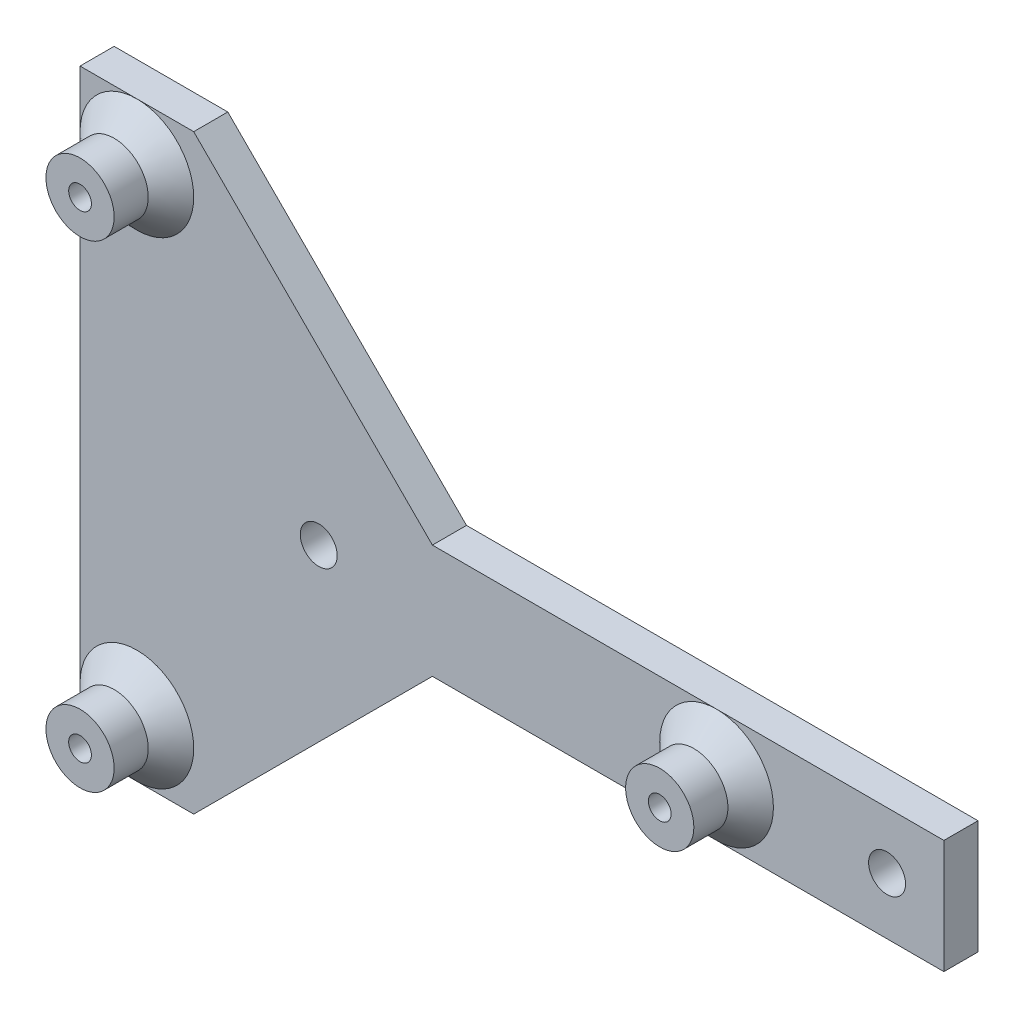
ISO-10303-21;
HEADER;
FILE_DESCRIPTION(('STEP AP214'),'2;1');
FILE_NAME('part.step','',(''),(''),'','','');
FILE_SCHEMA(('AUTOMOTIVE_DESIGN { 1 0 10303 214 1 1 1 1 }'));
ENDSEC;
DATA;
#1=APPLICATION_CONTEXT('core data for automotive mechanical design processes');
#2=APPLICATION_PROTOCOL_DEFINITION('international standard','automotive_design',2000,#1);
#3=PRODUCT_CONTEXT('',#1,'mechanical');
#4=PRODUCT('Part','Part','',(#3));
#5=PRODUCT_RELATED_PRODUCT_CATEGORY('part','',(#4));
#6=PRODUCT_DEFINITION_FORMATION('','',#4);
#7=PRODUCT_DEFINITION_CONTEXT('part definition',#1,'design');
#8=PRODUCT_DEFINITION('design','',#6,#7);
#9=PRODUCT_DEFINITION_SHAPE('','',#8);
#10=(LENGTH_UNIT() NAMED_UNIT(*) SI_UNIT(.MILLI.,.METRE.));
#11=(NAMED_UNIT(*) PLANE_ANGLE_UNIT() SI_UNIT($,.RADIAN.));
#12=(NAMED_UNIT(*) SI_UNIT($,.STERADIAN.) SOLID_ANGLE_UNIT());
#13=UNCERTAINTY_MEASURE_WITH_UNIT(LENGTH_MEASURE(1.E-05),#10,'distance_accuracy_value','');
#14=(GEOMETRIC_REPRESENTATION_CONTEXT(3) GLOBAL_UNCERTAINTY_ASSIGNED_CONTEXT((#13)) GLOBAL_UNIT_ASSIGNED_CONTEXT((#10,
#11,#12)) REPRESENTATION_CONTEXT('',''));
#15=CARTESIAN_POINT('',(0.,0.,0.));
#16=DIRECTION('',(0.,0.,1.));
#17=DIRECTION('',(1.,0.,0.));
#18=AXIS2_PLACEMENT_3D('',#15,#16,#17);
#19=CARTESIAN_POINT('',(0.,0.,3.));
#20=DIRECTION('',(0.,0.,1.));
#21=DIRECTION('',(1.,0.,0.));
#22=AXIS2_PLACEMENT_3D('',#19,#20,#21);
#23=PLANE('',#22);
#24=CARTESIAN_POINT('',(0.,0.,3.));
#25=DIRECTION('',(0.,0.,1.));
#26=DIRECTION('',(1.,0.,0.));
#27=AXIS2_PLACEMENT_3D('',#24,#25,#26);
#28=CIRCLE('',#27,1.625);
#29=CARTESIAN_POINT('',(1.625,0.,3.));
#30=VERTEX_POINT('',#29);
#31=EDGE_CURVE('E230',#30,#30,#28,.T.);
#32=ORIENTED_EDGE('',*,*,#31,.F.);
#33=EDGE_LOOP('',(#32));
#34=FACE_BOUND('',#33,.T.);
#35=DIRECTION('',(-1.,0.,0.));
#36=VECTOR('',#35,1.);
#37=CARTESIAN_POINT('',(-5.,5.,3.));
#38=LINE('',#37,#36);
#39=CARTESIAN_POINT('',(5.,5.,3.));
#40=VERTEX_POINT('',#39);
#41=CARTESIAN_POINT('',(-15.,5.,3.));
#42=VERTEX_POINT('',#41);
#43=EDGE_CURVE('E234',#40,#42,#38,.T.);
#44=ORIENTED_EDGE('',*,*,#43,.T.);
#45=CARTESIAN_POINT('',(-15.,0.,3.));
#46=DIRECTION('',(0.,0.,1.));
#47=DIRECTION('',(1.,0.,0.));
#48=AXIS2_PLACEMENT_3D('',#45,#46,#47);
#49=CIRCLE('',#48,5.00000000000002);
#50=CARTESIAN_POINT('',(-15.,-5.,3.));
#51=VERTEX_POINT('',#50);
#52=EDGE_CURVE('E183',#42,#51,#49,.F.);
#53=ORIENTED_EDGE('',*,*,#52,.T.);
#54=DIRECTION('',(1.,0.,0.));
#55=VECTOR('',#54,1.);
#56=CARTESIAN_POINT('',(-5.,-5.,3.));
#57=LINE('',#56,#55);
#58=CARTESIAN_POINT('',(5.,-5.,3.));
#59=VERTEX_POINT('',#58);
#60=EDGE_CURVE('E233',#51,#59,#57,.T.);
#61=ORIENTED_EDGE('',*,*,#60,.T.);
#62=DIRECTION('',(0.,1.,0.));
#63=VECTOR('',#62,1.);
#64=CARTESIAN_POINT('',(5.,5.,3.));
#65=LINE('',#64,#63);
#66=EDGE_CURVE('E222',#59,#40,#65,.T.);
#67=ORIENTED_EDGE('',*,*,#66,.T.);
#68=EDGE_LOOP('',(#44,#53,#61,#67));
#69=FACE_BOUND('',#68,.T.);
#70=ADVANCED_FACE('F41',(#34,#69),#23,.T.);
#71=DIRECTION('',(0.,-1.,0.));
#72=VECTOR('',#71,1.);
#73=CARTESIAN_POINT('',(-71.,26.,3.));
#74=LINE('',#73,#72);
#75=CARTESIAN_POINT('',(-71.,26.,3.));
#76=VERTEX_POINT('',#75);
#77=CARTESIAN_POINT('',(-71.,21.,3.));
#78=VERTEX_POINT('',#77);
#79=EDGE_CURVE('E275',#76,#78,#74,.T.);
#80=ORIENTED_EDGE('',*,*,#79,.T.);
#81=CARTESIAN_POINT('',(-66.,21.,3.));
#82=DIRECTION('',(0.,0.,1.));
#83=DIRECTION('',(1.,0.,0.));
#84=AXIS2_PLACEMENT_3D('',#81,#82,#83);
#85=CIRCLE('',#84,5.00000000000003);
#86=CARTESIAN_POINT('',(-66.,26.,3.));
#87=VERTEX_POINT('',#86);
#88=EDGE_CURVE('E191',#78,#87,#85,.F.);
#89=ORIENTED_EDGE('',*,*,#88,.T.);
#90=DIRECTION('',(-1.,0.,0.));
#91=VECTOR('',#90,1.);
#92=CARTESIAN_POINT('',(-71.,26.,3.));
#93=LINE('',#92,#91);
#94=EDGE_CURVE('E283',#87,#76,#93,.T.);
#95=ORIENTED_EDGE('',*,*,#94,.T.);
#96=EDGE_LOOP('',(#80,#89,#95));
#97=FACE_BOUND('',#96,.T.);
#98=ADVANCED_FACE('F341',(#97),#23,.T.);
#99=DIRECTION('',(1.,0.,0.));
#100=VECTOR('',#99,1.);
#101=CARTESIAN_POINT('',(-71.,-26.,3.));
#102=LINE('',#101,#100);
#103=CARTESIAN_POINT('',(-66.,-26.,3.));
#104=VERTEX_POINT('',#103);
#105=CARTESIAN_POINT('',(-61.,-26.,3.));
#106=VERTEX_POINT('',#105);
#107=EDGE_CURVE('E274',#104,#106,#102,.T.);
#108=ORIENTED_EDGE('',*,*,#107,.T.);
#109=DIRECTION('',(0.707106781186544,0.707106781186551,0.));
#110=VECTOR('',#109,1.);
#111=CARTESIAN_POINT('',(-61.,-26.0000000000002,3.));
#112=LINE('',#111,#110);
#113=CARTESIAN_POINT('',(-40.0000000000001,-5.,3.));
#114=VERTEX_POINT('',#113);
#115=EDGE_CURVE('E51',#106,#114,#112,.T.);
#116=ORIENTED_EDGE('',*,*,#115,.T.);
#117=EDGE_CURVE('E58',#114,#51,#57,.T.);
#118=ORIENTED_EDGE('',*,*,#117,.T.);
#119=CARTESIAN_POINT('',(-15.,0.,3.));
#120=DIRECTION('',(0.,0.,1.));
#121=DIRECTION('',(1.,0.,0.));
#122=AXIS2_PLACEMENT_3D('',#119,#120,#121);
#123=CIRCLE('',#122,5.00000000000002);
#124=EDGE_CURVE('E179',#51,#42,#123,.F.);
#125=ORIENTED_EDGE('',*,*,#124,.T.);
#126=CARTESIAN_POINT('',(-39.9999999999999,5.,3.));
#127=VERTEX_POINT('',#126);
#128=EDGE_CURVE('E238',#42,#127,#38,.T.);
#129=ORIENTED_EDGE('',*,*,#128,.T.);
#130=DIRECTION('',(-0.707106781186549,0.707106781186546,0.));
#131=VECTOR('',#130,1.);
#132=CARTESIAN_POINT('',(-39.9999999999999,5.,3.));
#133=LINE('',#132,#131);
#134=CARTESIAN_POINT('',(-61.,26.,3.));
#135=VERTEX_POINT('',#134);
#136=EDGE_CURVE('E160',#127,#135,#133,.T.);
#137=ORIENTED_EDGE('',*,*,#136,.T.);
#138=EDGE_CURVE('E66',#135,#87,#93,.T.);
#139=ORIENTED_EDGE('',*,*,#138,.T.);
#140=CARTESIAN_POINT('',(-66.,21.,3.));
#141=DIRECTION('',(0.,0.,1.));
#142=DIRECTION('',(1.,0.,0.));
#143=AXIS2_PLACEMENT_3D('',#140,#141,#142);
#144=CIRCLE('',#143,5.00000000000003);
#145=CARTESIAN_POINT('',(-61.,21.,3.));
#146=VERTEX_POINT('',#145);
#147=EDGE_CURVE('E194',#87,#146,#144,.F.);
#148=ORIENTED_EDGE('',*,*,#147,.T.);
#149=CARTESIAN_POINT('',(-66.,21.,3.));
#150=DIRECTION('',(0.,0.,1.));
#151=DIRECTION('',(1.,0.,0.));
#152=AXIS2_PLACEMENT_3D('',#149,#150,#151);
#153=CIRCLE('',#152,5.00000000000003);
#154=EDGE_CURVE('E187',#146,#78,#153,.F.);
#155=ORIENTED_EDGE('',*,*,#154,.T.);
#156=CARTESIAN_POINT('',(-71.,-21.,3.));
#157=VERTEX_POINT('',#156);
#158=EDGE_CURVE('E279',#78,#157,#74,.T.);
#159=ORIENTED_EDGE('',*,*,#158,.T.);
#160=CARTESIAN_POINT('',(-66.,-21.,3.));
#161=DIRECTION('',(0.,0.,1.));
#162=DIRECTION('',(1.,0.,0.));
#163=AXIS2_PLACEMENT_3D('',#160,#161,#162);
#164=CIRCLE('',#163,5.00000000000003);
#165=CARTESIAN_POINT('',(-61.,-21.,3.));
#166=VERTEX_POINT('',#165);
#167=EDGE_CURVE('E204',#157,#166,#164,.F.);
#168=ORIENTED_EDGE('',*,*,#167,.T.);
#169=CARTESIAN_POINT('',(-66.,-21.,3.));
#170=DIRECTION('',(0.,0.,1.));
#171=DIRECTION('',(1.,0.,0.));
#172=AXIS2_PLACEMENT_3D('',#169,#170,#171);
#173=CIRCLE('',#172,5.00000000000003);
#174=EDGE_CURVE('E197',#166,#104,#173,.F.);
#175=ORIENTED_EDGE('',*,*,#174,.T.);
#176=EDGE_LOOP('',(#108,#116,#118,#125,#129,#137,#139,#148,#155,#159,#168,#175));
#177=FACE_BOUND('',#176,.T.);
#178=CARTESIAN_POINT('',(-50.,0.,3.));
#179=DIRECTION('',(0.,0.,1.));
#180=DIRECTION('',(1.,0.,0.));
#181=AXIS2_PLACEMENT_3D('',#178,#179,#180);
#182=CIRCLE('',#181,1.625);
#183=CARTESIAN_POINT('',(-48.375,0.,3.));
#184=VERTEX_POINT('',#183);
#185=EDGE_CURVE('E253',#184,#184,#182,.T.);
#186=ORIENTED_EDGE('',*,*,#185,.F.);
#187=EDGE_LOOP('',(#186));
#188=FACE_BOUND('',#187,.T.);
#189=ADVANCED_FACE('F348',(#177,#188),#23,.T.);
#190=CARTESIAN_POINT('',(-71.,-26.,3.));
#191=VERTEX_POINT('',#190);
#192=EDGE_CURVE('E153',#191,#104,#102,.T.);
#193=ORIENTED_EDGE('',*,*,#192,.T.);
#194=CARTESIAN_POINT('',(-66.,-21.,3.));
#195=DIRECTION('',(0.,0.,1.));
#196=DIRECTION('',(1.,0.,0.));
#197=AXIS2_PLACEMENT_3D('',#194,#195,#196);
#198=CIRCLE('',#197,5.00000000000003);
#199=EDGE_CURVE('E201',#104,#157,#198,.F.);
#200=ORIENTED_EDGE('',*,*,#199,.T.);
#201=EDGE_CURVE('E280',#157,#191,#74,.T.);
#202=ORIENTED_EDGE('',*,*,#201,.T.);
#203=EDGE_LOOP('',(#193,#200,#202));
#204=FACE_BOUND('',#203,.T.);
#205=ADVANCED_FACE('F344',(#204),#23,.T.);
#206=CARTESIAN_POINT('',(0.,0.,0.));
#207=DIRECTION('',(0.,0.,1.));
#208=DIRECTION('',(1.,0.,0.));
#209=AXIS2_PLACEMENT_3D('',#206,#207,#208);
#210=PLANE('',#209);
#211=DIRECTION('',(0.,1.,0.));
#212=VECTOR('',#211,1.);
#213=CARTESIAN_POINT('',(5.,5.,0.));
#214=LINE('',#213,#212);
#215=CARTESIAN_POINT('',(5.,-5.,0.));
#216=VERTEX_POINT('',#215);
#217=CARTESIAN_POINT('',(5.,5.,0.));
#218=VERTEX_POINT('',#217);
#219=EDGE_CURVE('E226',#216,#218,#214,.T.);
#220=ORIENTED_EDGE('',*,*,#219,.F.);
#221=DIRECTION('',(1.,0.,0.));
#222=VECTOR('',#221,1.);
#223=CARTESIAN_POINT('',(-5.,-5.,0.));
#224=LINE('',#223,#222);
#225=CARTESIAN_POINT('',(-40.0000000000001,-5.,0.));
#226=VERTEX_POINT('',#225);
#227=EDGE_CURVE('E219',#226,#216,#224,.T.);
#228=ORIENTED_EDGE('',*,*,#227,.F.);
#229=DIRECTION('',(-0.707106781186544,-0.707106781186551,0.));
#230=VECTOR('',#229,1.);
#231=CARTESIAN_POINT('',(-17.5000000000002,17.5000000000001,0.));
#232=LINE('',#231,#230);
#233=CARTESIAN_POINT('',(-61.,-26.,0.));
#234=VERTEX_POINT('',#233);
#235=EDGE_CURVE('E11',#226,#234,#232,.T.);
#236=ORIENTED_EDGE('',*,*,#235,.T.);
#237=DIRECTION('',(1.,0.,0.));
#238=VECTOR('',#237,1.);
#239=CARTESIAN_POINT('',(-71.,-26.,0.));
#240=LINE('',#239,#238);
#241=CARTESIAN_POINT('',(-71.,-26.,0.));
#242=VERTEX_POINT('',#241);
#243=EDGE_CURVE('E140',#242,#234,#240,.T.);
#244=ORIENTED_EDGE('',*,*,#243,.F.);
#245=DIRECTION('',(0.,-1.,0.));
#246=VECTOR('',#245,1.);
#247=CARTESIAN_POINT('',(-71.,26.,0.));
#248=LINE('',#247,#246);
#249=CARTESIAN_POINT('',(-71.,26.,0.));
#250=VERTEX_POINT('',#249);
#251=EDGE_CURVE('E151',#250,#242,#248,.T.);
#252=ORIENTED_EDGE('',*,*,#251,.F.);
#253=DIRECTION('',(-1.,0.,0.));
#254=VECTOR('',#253,1.);
#255=CARTESIAN_POINT('',(-71.,26.,0.));
#256=LINE('',#255,#254);
#257=CARTESIAN_POINT('',(-61.,26.,0.));
#258=VERTEX_POINT('',#257);
#259=EDGE_CURVE('E135',#258,#250,#256,.T.);
#260=ORIENTED_EDGE('',*,*,#259,.F.);
#261=DIRECTION('',(0.707106781186549,-0.707106781186546,0.));
#262=VECTOR('',#261,1.);
#263=CARTESIAN_POINT('',(-17.4999999999998,-17.4999999999999,0.));
#264=LINE('',#263,#262);
#265=CARTESIAN_POINT('',(-39.9999999999999,5.,0.));
#266=VERTEX_POINT('',#265);
#267=EDGE_CURVE('E147',#258,#266,#264,.T.);
#268=ORIENTED_EDGE('',*,*,#267,.T.);
#269=DIRECTION('',(-1.,0.,0.));
#270=VECTOR('',#269,1.);
#271=CARTESIAN_POINT('',(-5.,5.,0.));
#272=LINE('',#271,#270);
#273=EDGE_CURVE('E223',#218,#266,#272,.T.);
#274=ORIENTED_EDGE('',*,*,#273,.F.);
#275=EDGE_LOOP('',(#220,#228,#236,#244,#252,#260,#268,#274));
#276=FACE_BOUND('',#275,.T.);
#277=CARTESIAN_POINT('',(0.,0.,0.));
#278=DIRECTION('',(0.,0.,1.));
#279=DIRECTION('',(1.,0.,0.));
#280=AXIS2_PLACEMENT_3D('',#277,#278,#279);
#281=CIRCLE('',#280,1.625);
#282=CARTESIAN_POINT('',(1.625,0.,0.));
#283=VERTEX_POINT('',#282);
#284=EDGE_CURVE('E242',#283,#283,#281,.T.);
#285=ORIENTED_EDGE('',*,*,#284,.T.);
#286=EDGE_LOOP('',(#285));
#287=FACE_BOUND('',#286,.T.);
#288=CARTESIAN_POINT('',(-15.,0.,0.));
#289=DIRECTION('',(0.,0.,1.));
#290=DIRECTION('',(1.,0.,0.));
#291=AXIS2_PLACEMENT_3D('',#288,#289,#290);
#292=CIRCLE('',#291,1.);
#293=CARTESIAN_POINT('',(-14.,0.,0.));
#294=VERTEX_POINT('',#293);
#295=EDGE_CURVE('E246',#294,#294,#292,.T.);
#296=ORIENTED_EDGE('',*,*,#295,.T.);
#297=EDGE_LOOP('',(#296));
#298=FACE_BOUND('',#297,.T.);
#299=CARTESIAN_POINT('',(-50.,0.,0.));
#300=DIRECTION('',(0.,0.,1.));
#301=DIRECTION('',(1.,0.,0.));
#302=AXIS2_PLACEMENT_3D('',#299,#300,#301);
#303=CIRCLE('',#302,1.625);
#304=CARTESIAN_POINT('',(-48.375,0.,0.));
#305=VERTEX_POINT('',#304);
#306=EDGE_CURVE('E254',#305,#305,#303,.T.);
#307=ORIENTED_EDGE('',*,*,#306,.T.);
#308=EDGE_LOOP('',(#307));
#309=FACE_BOUND('',#308,.T.);
#310=CARTESIAN_POINT('',(-66.,-21.,0.));
#311=DIRECTION('',(0.,0.,1.));
#312=DIRECTION('',(1.,0.,0.));
#313=AXIS2_PLACEMENT_3D('',#310,#311,#312);
#314=CIRCLE('',#313,0.999999999999998);
#315=CARTESIAN_POINT('',(-65.,-21.,0.));
#316=VERTEX_POINT('',#315);
#317=EDGE_CURVE('E293',#316,#316,#314,.T.);
#318=ORIENTED_EDGE('',*,*,#317,.T.);
#319=EDGE_LOOP('',(#318));
#320=FACE_BOUND('',#319,.T.);
#321=CARTESIAN_POINT('',(-66.,21.,0.));
#322=DIRECTION('',(0.,0.,1.));
#323=DIRECTION('',(1.,0.,0.));
#324=AXIS2_PLACEMENT_3D('',#321,#322,#323);
#325=CIRCLE('',#324,0.999999999999998);
#326=CARTESIAN_POINT('',(-65.,21.,0.));
#327=VERTEX_POINT('',#326);
#328=EDGE_CURVE('E289',#327,#327,#325,.T.);
#329=ORIENTED_EDGE('',*,*,#328,.T.);
#330=EDGE_LOOP('',(#329));
#331=FACE_BOUND('',#330,.T.);
#332=ADVANCED_FACE('F145',(#276,#287,#298,#309,#320,#331),#210,.F.);
#333=CARTESIAN_POINT('',(5.,5.,3.));
#334=DIRECTION('',(-1.,0.,0.));
#335=DIRECTION('',(0.,-1.,0.));
#336=AXIS2_PLACEMENT_3D('',#333,#334,#335);
#337=PLANE('',#336);
#338=ORIENTED_EDGE('',*,*,#219,.T.);
#339=DIRECTION('',(0.,0.,-1.));
#340=VECTOR('',#339,1.);
#341=CARTESIAN_POINT('',(5.,5.,3.));
#342=LINE('',#341,#340);
#343=EDGE_CURVE('E211',#40,#218,#342,.T.);
#344=ORIENTED_EDGE('',*,*,#343,.F.);
#345=ORIENTED_EDGE('',*,*,#66,.F.);
#346=DIRECTION('',(0.,0.,-1.));
#347=VECTOR('',#346,1.);
#348=CARTESIAN_POINT('',(5.,-5.,3.));
#349=LINE('',#348,#347);
#350=EDGE_CURVE('E215',#59,#216,#349,.T.);
#351=ORIENTED_EDGE('',*,*,#350,.T.);
#352=EDGE_LOOP('',(#338,#344,#345,#351));
#353=FACE_BOUND('',#352,.T.);
#354=ADVANCED_FACE('F360',(#353),#337,.F.);
#355=CARTESIAN_POINT('',(-5.,5.,3.));
#356=DIRECTION('',(0.,-1.,0.));
#357=DIRECTION('',(0.,0.,-1.));
#358=AXIS2_PLACEMENT_3D('',#355,#356,#357);
#359=PLANE('',#358);
#360=ORIENTED_EDGE('',*,*,#273,.T.);
#361=DIRECTION('',(0.,0.,1.));
#362=VECTOR('',#361,1.);
#363=CARTESIAN_POINT('',(-39.9999999999999,5.,3.));
#364=LINE('',#363,#362);
#365=EDGE_CURVE('E158',#266,#127,#364,.T.);
#366=ORIENTED_EDGE('',*,*,#365,.T.);
#367=ORIENTED_EDGE('',*,*,#128,.F.);
#368=ORIENTED_EDGE('',*,*,#43,.F.);
#369=ORIENTED_EDGE('',*,*,#343,.T.);
#370=EDGE_LOOP('',(#360,#366,#367,#368,#369));
#371=FACE_BOUND('',#370,.T.);
#372=ADVANCED_FACE('F434',(#371),#359,.F.);
#373=CARTESIAN_POINT('',(-5.,-5.,3.));
#374=DIRECTION('',(0.,1.,0.));
#375=DIRECTION('',(0.,0.,1.));
#376=AXIS2_PLACEMENT_3D('',#373,#374,#375);
#377=PLANE('',#376);
#378=ORIENTED_EDGE('',*,*,#117,.F.);
#379=DIRECTION('',(0.,0.,-1.));
#380=VECTOR('',#379,1.);
#381=CARTESIAN_POINT('',(-40.0000000000001,-5.,3.));
#382=LINE('',#381,#380);
#383=EDGE_CURVE('E164',#114,#226,#382,.T.);
#384=ORIENTED_EDGE('',*,*,#383,.T.);
#385=ORIENTED_EDGE('',*,*,#227,.T.);
#386=ORIENTED_EDGE('',*,*,#350,.F.);
#387=ORIENTED_EDGE('',*,*,#60,.F.);
#388=EDGE_LOOP('',(#378,#384,#385,#386,#387));
#389=FACE_BOUND('',#388,.T.);
#390=ADVANCED_FACE('F429',(#389),#377,.F.);
#391=CARTESIAN_POINT('',(0.,0.,3.));
#392=DIRECTION('',(0.,0.,-1.));
#393=DIRECTION('',(-1.,0.,0.));
#394=AXIS2_PLACEMENT_3D('',#391,#392,#393);
#395=CYLINDRICAL_SURFACE('',#394,1.625);
#396=ORIENTED_EDGE('',*,*,#31,.T.);
#397=EDGE_LOOP('',(#396));
#398=FACE_BOUND('',#397,.T.);
#399=ORIENTED_EDGE('',*,*,#284,.F.);
#400=EDGE_LOOP('',(#399));
#401=FACE_BOUND('',#400,.T.);
#402=ADVANCED_FACE('F426',(#398,#401),#395,.F.);
#403=CARTESIAN_POINT('',(-15.,0.,0.));
#404=DIRECTION('',(0.,0.,1.));
#405=DIRECTION('',(1.,0.,0.));
#406=AXIS2_PLACEMENT_3D('',#403,#404,#405);
#407=CYLINDRICAL_SURFACE('',#406,1.);
#408=ORIENTED_EDGE('',*,*,#295,.F.);
#409=EDGE_LOOP('',(#408));
#410=FACE_BOUND('',#409,.T.);
#411=CARTESIAN_POINT('',(-15.,0.,8.));
#412=DIRECTION('',(0.,0.,1.));
#413=DIRECTION('',(1.,0.,0.));
#414=AXIS2_PLACEMENT_3D('',#411,#412,#413);
#415=CIRCLE('',#414,1.);
#416=CARTESIAN_POINT('',(-14.,0.,8.));
#417=VERTEX_POINT('',#416);
#418=EDGE_CURVE('E317',#417,#417,#415,.T.);
#419=ORIENTED_EDGE('',*,*,#418,.T.);
#420=EDGE_LOOP('',(#419));
#421=FACE_BOUND('',#420,.T.);
#422=ADVANCED_FACE('F322',(#410,#421),#407,.F.);
#423=CARTESIAN_POINT('',(-50.,0.,3.));
#424=DIRECTION('',(0.,0.,-1.));
#425=DIRECTION('',(-1.,0.,0.));
#426=AXIS2_PLACEMENT_3D('',#423,#424,#425);
#427=CYLINDRICAL_SURFACE('',#426,1.625);
#428=ORIENTED_EDGE('',*,*,#185,.T.);
#429=EDGE_LOOP('',(#428));
#430=FACE_BOUND('',#429,.T.);
#431=ORIENTED_EDGE('',*,*,#306,.F.);
#432=EDGE_LOOP('',(#431));
#433=FACE_BOUND('',#432,.T.);
#434=ADVANCED_FACE('F417',(#430,#433),#427,.F.);
#435=CARTESIAN_POINT('',(-71.,-26.,0.));
#436=DIRECTION('',(0.,-1.,0.));
#437=DIRECTION('',(0.,0.,-1.));
#438=AXIS2_PLACEMENT_3D('',#435,#436,#437);
#439=PLANE('',#438);
#440=ORIENTED_EDGE('',*,*,#192,.F.);
#441=DIRECTION('',(0.,0.,1.));
#442=VECTOR('',#441,1.);
#443=CARTESIAN_POINT('',(-71.,-26.,0.));
#444=LINE('',#443,#442);
#445=EDGE_CURVE('E264',#242,#191,#444,.T.);
#446=ORIENTED_EDGE('',*,*,#445,.F.);
#447=ORIENTED_EDGE('',*,*,#243,.T.);
#448=DIRECTION('',(0.,0.,1.));
#449=VECTOR('',#448,1.);
#450=CARTESIAN_POINT('',(-61.,-26.,0.));
#451=LINE('',#450,#449);
#452=EDGE_CURVE('E258',#234,#106,#451,.T.);
#453=ORIENTED_EDGE('',*,*,#452,.T.);
#454=ORIENTED_EDGE('',*,*,#107,.F.);
#455=EDGE_LOOP('',(#440,#446,#447,#453,#454));
#456=FACE_BOUND('',#455,.T.);
#457=ADVANCED_FACE('F366',(#456),#439,.T.);
#458=CARTESIAN_POINT('',(-71.,26.,0.));
#459=DIRECTION('',(-1.,0.,0.));
#460=DIRECTION('',(0.,0.,1.));
#461=AXIS2_PLACEMENT_3D('',#458,#459,#460);
#462=PLANE('',#461);
#463=ORIENTED_EDGE('',*,*,#79,.F.);
#464=DIRECTION('',(0.,0.,1.));
#465=VECTOR('',#464,1.);
#466=CARTESIAN_POINT('',(-71.,26.,0.));
#467=LINE('',#466,#465);
#468=EDGE_CURVE('E139',#250,#76,#467,.T.);
#469=ORIENTED_EDGE('',*,*,#468,.F.);
#470=ORIENTED_EDGE('',*,*,#251,.T.);
#471=ORIENTED_EDGE('',*,*,#445,.T.);
#472=ORIENTED_EDGE('',*,*,#201,.F.);
#473=ORIENTED_EDGE('',*,*,#158,.F.);
#474=EDGE_LOOP('',(#463,#469,#470,#471,#472,#473));
#475=FACE_BOUND('',#474,.T.);
#476=ADVANCED_FACE('F377',(#475),#462,.T.);
#477=CARTESIAN_POINT('',(-71.,26.,0.));
#478=DIRECTION('',(0.,1.,0.));
#479=DIRECTION('',(0.,0.,1.));
#480=AXIS2_PLACEMENT_3D('',#477,#478,#479);
#481=PLANE('',#480);
#482=ORIENTED_EDGE('',*,*,#138,.F.);
#483=DIRECTION('',(0.,0.,1.));
#484=VECTOR('',#483,1.);
#485=CARTESIAN_POINT('',(-61.,26.,0.));
#486=LINE('',#485,#484);
#487=EDGE_CURVE('E131',#258,#135,#486,.T.);
#488=ORIENTED_EDGE('',*,*,#487,.F.);
#489=ORIENTED_EDGE('',*,*,#259,.T.);
#490=ORIENTED_EDGE('',*,*,#468,.T.);
#491=ORIENTED_EDGE('',*,*,#94,.F.);
#492=EDGE_LOOP('',(#482,#488,#489,#490,#491));
#493=FACE_BOUND('',#492,.T.);
#494=ADVANCED_FACE('F133',(#493),#481,.T.);
#495=CARTESIAN_POINT('',(-66.,21.,0.));
#496=DIRECTION('',(0.,0.,1.));
#497=DIRECTION('',(1.,0.,0.));
#498=AXIS2_PLACEMENT_3D('',#495,#496,#497);
#499=CYLINDRICAL_SURFACE('',#498,0.999999999999998);
#500=ORIENTED_EDGE('',*,*,#328,.F.);
#501=EDGE_LOOP('',(#500));
#502=FACE_BOUND('',#501,.T.);
#503=CARTESIAN_POINT('',(-66.,21.,8.));
#504=DIRECTION('',(0.,0.,1.));
#505=DIRECTION('',(1.,0.,0.));
#506=AXIS2_PLACEMENT_3D('',#503,#504,#505);
#507=CIRCLE('',#506,0.999999999999998);
#508=CARTESIAN_POINT('',(-65.,21.,8.));
#509=VERTEX_POINT('',#508);
#510=EDGE_CURVE('E301',#509,#509,#507,.T.);
#511=ORIENTED_EDGE('',*,*,#510,.T.);
#512=EDGE_LOOP('',(#511));
#513=FACE_BOUND('',#512,.T.);
#514=ADVANCED_FACE('F401',(#502,#513),#499,.F.);
#515=CARTESIAN_POINT('',(-66.,-21.,0.));
#516=DIRECTION('',(0.,0.,1.));
#517=DIRECTION('',(1.,0.,0.));
#518=AXIS2_PLACEMENT_3D('',#515,#516,#517);
#519=CYLINDRICAL_SURFACE('',#518,0.999999999999998);
#520=ORIENTED_EDGE('',*,*,#317,.F.);
#521=EDGE_LOOP('',(#520));
#522=FACE_BOUND('',#521,.T.);
#523=CARTESIAN_POINT('',(-66.,-21.,8.));
#524=DIRECTION('',(0.,0.,1.));
#525=DIRECTION('',(1.,0.,0.));
#526=AXIS2_PLACEMENT_3D('',#523,#524,#525);
#527=CIRCLE('',#526,0.999999999999998);
#528=CARTESIAN_POINT('',(-65.,-21.,8.));
#529=VERTEX_POINT('',#528);
#530=EDGE_CURVE('E309',#529,#529,#527,.T.);
#531=ORIENTED_EDGE('',*,*,#530,.T.);
#532=EDGE_LOOP('',(#531));
#533=FACE_BOUND('',#532,.T.);
#534=ADVANCED_FACE('F398',(#522,#533),#519,.F.);
#535=CARTESIAN_POINT('',(-66.,21.,8.));
#536=DIRECTION('',(0.,0.,1.));
#537=DIRECTION('',(1.,0.,0.));
#538=AXIS2_PLACEMENT_3D('',#535,#536,#537);
#539=PLANE('',#538);
#540=CARTESIAN_POINT('',(-66.,21.,8.));
#541=DIRECTION('',(0.,0.,1.));
#542=DIRECTION('',(1.,0.,0.));
#543=AXIS2_PLACEMENT_3D('',#540,#541,#542);
#544=CIRCLE('',#543,3.00000000000001);
#545=CARTESIAN_POINT('',(-63.,21.,8.));
#546=VERTEX_POINT('',#545);
#547=EDGE_CURVE('E297',#546,#546,#544,.T.);
#548=ORIENTED_EDGE('',*,*,#547,.T.);
#549=EDGE_LOOP('',(#548));
#550=FACE_BOUND('',#549,.T.);
#551=ORIENTED_EDGE('',*,*,#510,.F.);
#552=EDGE_LOOP('',(#551));
#553=FACE_BOUND('',#552,.T.);
#554=ADVANCED_FACE('F400',(#550,#553),#539,.T.);
#555=CARTESIAN_POINT('',(-66.,21.,8.));
#556=DIRECTION('',(0.,0.,-1.));
#557=DIRECTION('',(-1.,0.,0.));
#558=AXIS2_PLACEMENT_3D('',#555,#556,#557);
#559=CYLINDRICAL_SURFACE('',#558,3.00000000000001);
#560=CARTESIAN_POINT('',(-66.,21.,5.00000000000005));
#561=DIRECTION('',(0.,0.,1.));
#562=DIRECTION('',(1.,0.,0.));
#563=AXIS2_PLACEMENT_3D('',#560,#561,#562);
#564=CIRCLE('',#563,3.00000000000001);
#565=CARTESIAN_POINT('',(-63.,21.,5.00000000000005));
#566=VERTEX_POINT('',#565);
#567=EDGE_CURVE('E175',#566,#566,#564,.T.);
#568=ORIENTED_EDGE('',*,*,#567,.T.);
#569=EDGE_LOOP('',(#568));
#570=FACE_BOUND('',#569,.T.);
#571=ORIENTED_EDGE('',*,*,#547,.F.);
#572=EDGE_LOOP('',(#571));
#573=FACE_BOUND('',#572,.T.);
#574=ADVANCED_FACE('F394',(#570,#573),#559,.T.);
#575=CARTESIAN_POINT('',(-66.,-21.,8.));
#576=DIRECTION('',(0.,0.,1.));
#577=DIRECTION('',(1.,0.,0.));
#578=AXIS2_PLACEMENT_3D('',#575,#576,#577);
#579=PLANE('',#578);
#580=CARTESIAN_POINT('',(-66.,-21.,8.));
#581=DIRECTION('',(0.,0.,1.));
#582=DIRECTION('',(1.,0.,0.));
#583=AXIS2_PLACEMENT_3D('',#580,#581,#582);
#584=CIRCLE('',#583,3.00000000000001);
#585=CARTESIAN_POINT('',(-63.,-21.,8.));
#586=VERTEX_POINT('',#585);
#587=EDGE_CURVE('E305',#586,#586,#584,.T.);
#588=ORIENTED_EDGE('',*,*,#587,.T.);
#589=EDGE_LOOP('',(#588));
#590=FACE_BOUND('',#589,.T.);
#591=ORIENTED_EDGE('',*,*,#530,.F.);
#592=EDGE_LOOP('',(#591));
#593=FACE_BOUND('',#592,.T.);
#594=ADVANCED_FACE('F337',(#590,#593),#579,.T.);
#595=CARTESIAN_POINT('',(-66.,-21.,8.));
#596=DIRECTION('',(0.,0.,-1.));
#597=DIRECTION('',(-1.,0.,0.));
#598=AXIS2_PLACEMENT_3D('',#595,#596,#597);
#599=CYLINDRICAL_SURFACE('',#598,3.00000000000001);
#600=CARTESIAN_POINT('',(-66.,-21.,5.00000000000005));
#601=DIRECTION('',(0.,0.,1.));
#602=DIRECTION('',(1.,0.,0.));
#603=AXIS2_PLACEMENT_3D('',#600,#601,#602);
#604=CIRCLE('',#603,3.00000000000001);
#605=CARTESIAN_POINT('',(-63.,-21.,5.00000000000005));
#606=VERTEX_POINT('',#605);
#607=EDGE_CURVE('E171',#606,#606,#604,.T.);
#608=ORIENTED_EDGE('',*,*,#607,.T.);
#609=EDGE_LOOP('',(#608));
#610=FACE_BOUND('',#609,.T.);
#611=ORIENTED_EDGE('',*,*,#587,.F.);
#612=EDGE_LOOP('',(#611));
#613=FACE_BOUND('',#612,.T.);
#614=ADVANCED_FACE('F327',(#610,#613),#599,.T.);
#615=CARTESIAN_POINT('',(-15.,0.,8.));
#616=DIRECTION('',(0.,0.,1.));
#617=DIRECTION('',(1.,0.,0.));
#618=AXIS2_PLACEMENT_3D('',#615,#616,#617);
#619=PLANE('',#618);
#620=CARTESIAN_POINT('',(-15.,0.,8.));
#621=DIRECTION('',(0.,0.,1.));
#622=DIRECTION('',(1.,0.,0.));
#623=AXIS2_PLACEMENT_3D('',#620,#621,#622);
#624=CIRCLE('',#623,3.);
#625=CARTESIAN_POINT('',(-12.,0.,8.));
#626=VERTEX_POINT('',#625);
#627=EDGE_CURVE('E313',#626,#626,#624,.T.);
#628=ORIENTED_EDGE('',*,*,#627,.T.);
#629=EDGE_LOOP('',(#628));
#630=FACE_BOUND('',#629,.T.);
#631=ORIENTED_EDGE('',*,*,#418,.F.);
#632=EDGE_LOOP('',(#631));
#633=FACE_BOUND('',#632,.T.);
#634=ADVANCED_FACE('F324',(#630,#633),#619,.T.);
#635=CARTESIAN_POINT('',(-15.,0.,8.));
#636=DIRECTION('',(0.,0.,-1.));
#637=DIRECTION('',(-1.,0.,0.));
#638=AXIS2_PLACEMENT_3D('',#635,#636,#637);
#639=CYLINDRICAL_SURFACE('',#638,3.);
#640=CARTESIAN_POINT('',(-15.,0.,5.00000000000003));
#641=DIRECTION('',(0.,0.,1.));
#642=DIRECTION('',(1.,0.,0.));
#643=AXIS2_PLACEMENT_3D('',#640,#641,#642);
#644=CIRCLE('',#643,3.);
#645=CARTESIAN_POINT('',(-12.,0.,5.00000000000003));
#646=VERTEX_POINT('',#645);
#647=EDGE_CURVE('E207',#646,#646,#644,.T.);
#648=ORIENTED_EDGE('',*,*,#647,.T.);
#649=EDGE_LOOP('',(#648));
#650=FACE_BOUND('',#649,.T.);
#651=ORIENTED_EDGE('',*,*,#627,.F.);
#652=EDGE_LOOP('',(#651));
#653=FACE_BOUND('',#652,.T.);
#654=ADVANCED_FACE('F326',(#650,#653),#639,.T.);
#655=CARTESIAN_POINT('',(-15.,0.,5.00000000000003));
#656=DIRECTION('',(0.,0.,-1.));
#657=DIRECTION('',(-1.,0.,0.));
#658=AXIS2_PLACEMENT_3D('',#655,#656,#657);
#659=CONICAL_SURFACE('',#658,3.,0.785398163397446);
#660=ORIENTED_EDGE('',*,*,#52,.F.);
#661=ORIENTED_EDGE('',*,*,#124,.F.);
#662=EDGE_LOOP('',(#660,#661));
#663=FACE_BOUND('',#662,.T.);
#664=ORIENTED_EDGE('',*,*,#647,.F.);
#665=EDGE_LOOP('',(#664));
#666=FACE_BOUND('',#665,.T.);
#667=ADVANCED_FACE('F334',(#663,#666),#659,.T.);
#668=CARTESIAN_POINT('',(-66.,21.,5.00000000000005));
#669=DIRECTION('',(0.,0.,-1.));
#670=DIRECTION('',(-1.,0.,0.));
#671=AXIS2_PLACEMENT_3D('',#668,#669,#670);
#672=CONICAL_SURFACE('',#671,3.00000000000001,0.785398163397442);
#673=ORIENTED_EDGE('',*,*,#88,.F.);
#674=ORIENTED_EDGE('',*,*,#154,.F.);
#675=ORIENTED_EDGE('',*,*,#147,.F.);
#676=EDGE_LOOP('',(#673,#674,#675));
#677=FACE_BOUND('',#676,.T.);
#678=ORIENTED_EDGE('',*,*,#567,.F.);
#679=EDGE_LOOP('',(#678));
#680=FACE_BOUND('',#679,.T.);
#681=ADVANCED_FACE('F386',(#677,#680),#672,.T.);
#682=CARTESIAN_POINT('',(-66.,-21.,5.00000000000005));
#683=DIRECTION('',(0.,0.,-1.));
#684=DIRECTION('',(-1.,0.,0.));
#685=AXIS2_PLACEMENT_3D('',#682,#683,#684);
#686=CONICAL_SURFACE('',#685,3.00000000000001,0.785398163397442);
#687=ORIENTED_EDGE('',*,*,#199,.F.);
#688=ORIENTED_EDGE('',*,*,#174,.F.);
#689=ORIENTED_EDGE('',*,*,#167,.F.);
#690=EDGE_LOOP('',(#687,#688,#689));
#691=FACE_BOUND('',#690,.T.);
#692=ORIENTED_EDGE('',*,*,#607,.F.);
#693=EDGE_LOOP('',(#692));
#694=FACE_BOUND('',#693,.T.);
#695=ADVANCED_FACE('F383',(#691,#694),#686,.T.);
#696=CARTESIAN_POINT('',(-39.9999999999999,5.,3.));
#697=DIRECTION('',(-0.707106781186546,-0.707106781186549,0.));
#698=DIRECTION('',(0.,0.,1.));
#699=AXIS2_PLACEMENT_3D('',#696,#697,#698);
#700=PLANE('',#699);
#701=ORIENTED_EDGE('',*,*,#267,.F.);
#702=ORIENTED_EDGE('',*,*,#487,.T.);
#703=ORIENTED_EDGE('',*,*,#136,.F.);
#704=ORIENTED_EDGE('',*,*,#365,.F.);
#705=EDGE_LOOP('',(#701,#702,#703,#704));
#706=FACE_BOUND('',#705,.T.);
#707=ADVANCED_FACE('F156',(#706),#700,.F.);
#708=CARTESIAN_POINT('',(-61.,-26.0000000000002,0.));
#709=DIRECTION('',(-0.707106781186551,0.707106781186544,0.));
#710=DIRECTION('',(0.,0.,1.));
#711=AXIS2_PLACEMENT_3D('',#708,#709,#710);
#712=PLANE('',#711);
#713=ORIENTED_EDGE('',*,*,#235,.F.);
#714=ORIENTED_EDGE('',*,*,#383,.F.);
#715=ORIENTED_EDGE('',*,*,#115,.F.);
#716=ORIENTED_EDGE('',*,*,#452,.F.);
#717=EDGE_LOOP('',(#713,#714,#715,#716));
#718=FACE_BOUND('',#717,.T.);
#719=ADVANCED_FACE('F44',(#718),#712,.F.);
#720=CLOSED_SHELL('',(#70,#98,#189,#205,#332,#354,#372,#390,#402,#422,#434,#457,#476,#494,#514,
#534,#554,#574,#594,#614,#634,#654,#667,#681,#695,#707,#719));
#721=MANIFOLD_SOLID_BREP('B2',#720);
#722=ADVANCED_BREP_SHAPE_REPRESENTATION('',(#18,#721),#14);
#723=SHAPE_DEFINITION_REPRESENTATION(#9,#722);
ENDSEC;
END-ISO-10303-21;
